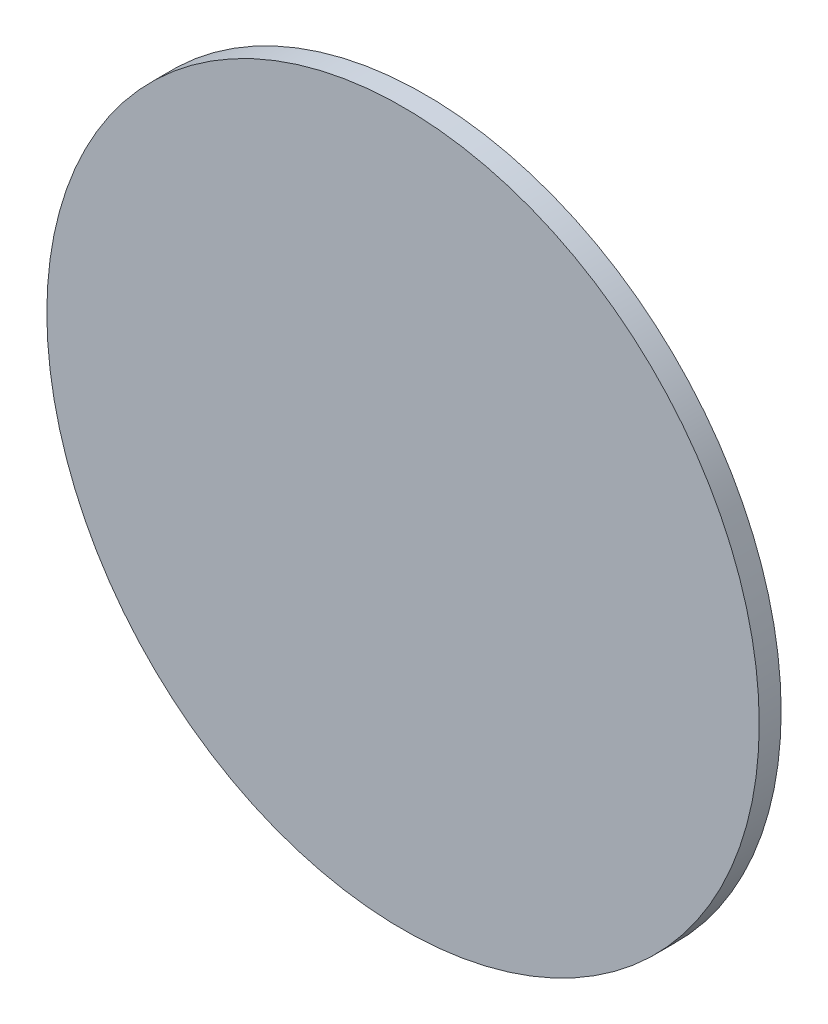
ISO-10303-21;
HEADER;
FILE_DESCRIPTION(('STEP AP214'),'2;1');
FILE_NAME('part.step','',(''),(''),'','','');
FILE_SCHEMA(('AUTOMOTIVE_DESIGN { 1 0 10303 214 1 1 1 1 }'));
ENDSEC;
DATA;
#1=APPLICATION_CONTEXT('core data for automotive mechanical design processes');
#2=APPLICATION_PROTOCOL_DEFINITION('international standard','automotive_design',2000,#1);
#3=PRODUCT_CONTEXT('',#1,'mechanical');
#4=PRODUCT('Part','Part','',(#3));
#5=PRODUCT_RELATED_PRODUCT_CATEGORY('part','',(#4));
#6=PRODUCT_DEFINITION_FORMATION('','',#4);
#7=PRODUCT_DEFINITION_CONTEXT('part definition',#1,'design');
#8=PRODUCT_DEFINITION('design','',#6,#7);
#9=PRODUCT_DEFINITION_SHAPE('','',#8);
#10=(LENGTH_UNIT() NAMED_UNIT(*) SI_UNIT(.MILLI.,.METRE.));
#11=(NAMED_UNIT(*) PLANE_ANGLE_UNIT() SI_UNIT($,.RADIAN.));
#12=(NAMED_UNIT(*) SI_UNIT($,.STERADIAN.) SOLID_ANGLE_UNIT());
#13=UNCERTAINTY_MEASURE_WITH_UNIT(LENGTH_MEASURE(1.E-05),#10,'distance_accuracy_value','');
#14=(GEOMETRIC_REPRESENTATION_CONTEXT(3) GLOBAL_UNCERTAINTY_ASSIGNED_CONTEXT((#13)) GLOBAL_UNIT_ASSIGNED_CONTEXT((#10,
#11,#12)) REPRESENTATION_CONTEXT('',''));
#15=CARTESIAN_POINT('',(0.,0.,0.));
#16=DIRECTION('',(0.,0.,1.));
#17=DIRECTION('',(1.,0.,0.));
#18=AXIS2_PLACEMENT_3D('',#15,#16,#17);
#19=CARTESIAN_POINT('',(0.,0.,0.8));
#20=DIRECTION('',(0.,0.,-1.));
#21=DIRECTION('',(-1.,0.,0.));
#22=AXIS2_PLACEMENT_3D('',#19,#20,#21);
#23=CYLINDRICAL_SURFACE('',#22,13.);
#24=CARTESIAN_POINT('',(0.,0.,0.8));
#25=DIRECTION('',(0.,0.,1.));
#26=DIRECTION('',(1.,0.,0.));
#27=AXIS2_PLACEMENT_3D('',#24,#25,#26);
#28=CIRCLE('',#27,13.);
#29=CARTESIAN_POINT('',(13.,0.,0.8));
#30=VERTEX_POINT('',#29);
#31=EDGE_CURVE('E10',#30,#30,#28,.T.);
#32=ORIENTED_EDGE('',*,*,#31,.F.);
#33=EDGE_LOOP('',(#32));
#34=FACE_BOUND('',#33,.T.);
#35=CARTESIAN_POINT('',(0.,0.,0.));
#36=DIRECTION('',(0.,0.,1.));
#37=DIRECTION('',(1.,0.,0.));
#38=AXIS2_PLACEMENT_3D('',#35,#36,#37);
#39=CIRCLE('',#38,13.);
#40=CARTESIAN_POINT('',(13.,0.,0.));
#41=VERTEX_POINT('',#40);
#42=EDGE_CURVE('E40',#41,#41,#39,.T.);
#43=ORIENTED_EDGE('',*,*,#42,.T.);
#44=EDGE_LOOP('',(#43));
#45=FACE_BOUND('',#44,.T.);
#46=ADVANCED_FACE('F37',(#34,#45),#23,.T.);
#47=CARTESIAN_POINT('',(0.,0.,0.8));
#48=DIRECTION('',(0.,0.,1.));
#49=DIRECTION('',(1.,0.,0.));
#50=AXIS2_PLACEMENT_3D('',#47,#48,#49);
#51=PLANE('',#50);
#52=ORIENTED_EDGE('',*,*,#31,.T.);
#53=EDGE_LOOP('',(#52));
#54=FACE_BOUND('',#53,.T.);
#55=ADVANCED_FACE('F54',(#54),#51,.T.);
#56=CARTESIAN_POINT('',(0.,0.,0.));
#57=DIRECTION('',(0.,0.,1.));
#58=DIRECTION('',(1.,0.,0.));
#59=AXIS2_PLACEMENT_3D('',#56,#57,#58);
#60=PLANE('',#59);
#61=ORIENTED_EDGE('',*,*,#42,.F.);
#62=EDGE_LOOP('',(#61));
#63=FACE_BOUND('',#62,.T.);
#64=ADVANCED_FACE('F52',(#63),#60,.F.);
#65=CLOSED_SHELL('',(#46,#55,#64));
#66=MANIFOLD_SOLID_BREP('B2',#65);
#67=ADVANCED_BREP_SHAPE_REPRESENTATION('',(#18,#66),#14);
#68=SHAPE_DEFINITION_REPRESENTATION(#9,#67);
ENDSEC;
END-ISO-10303-21;
